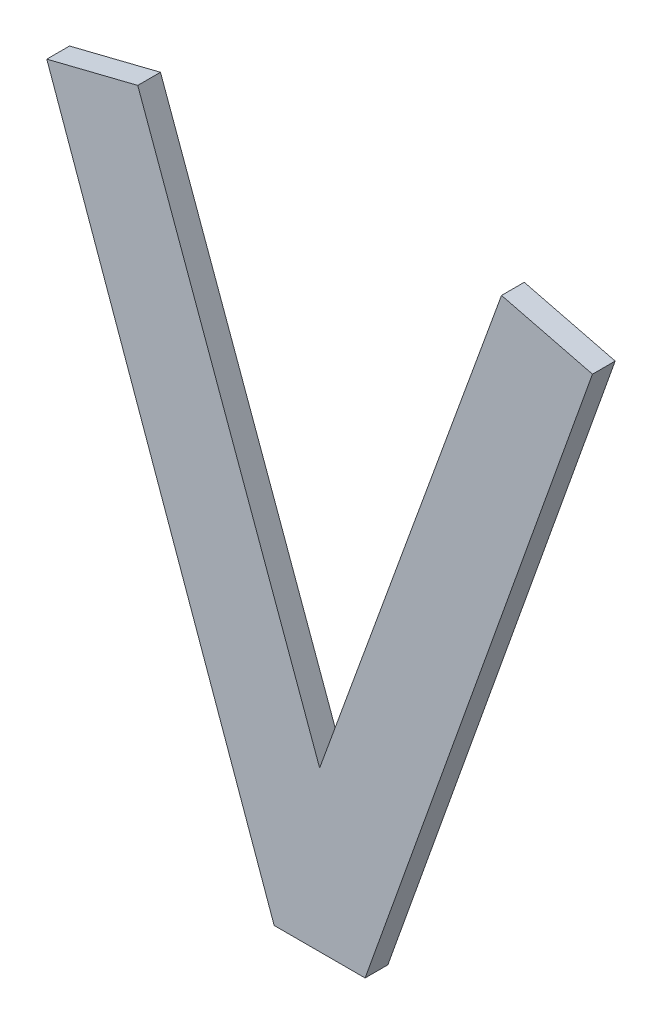
ISO-10303-21;
HEADER;
FILE_DESCRIPTION(('STEP AP214'),'2;1');
FILE_NAME('part.step','',(''),(''),'','','');
FILE_SCHEMA(('AUTOMOTIVE_DESIGN { 1 0 10303 214 1 1 1 1 }'));
ENDSEC;
DATA;
#1=APPLICATION_CONTEXT('core data for automotive mechanical design processes');
#2=APPLICATION_PROTOCOL_DEFINITION('international standard','automotive_design',2000,#1);
#3=PRODUCT_CONTEXT('',#1,'mechanical');
#4=PRODUCT('Part','Part','',(#3));
#5=PRODUCT_RELATED_PRODUCT_CATEGORY('part','',(#4));
#6=PRODUCT_DEFINITION_FORMATION('','',#4);
#7=PRODUCT_DEFINITION_CONTEXT('part definition',#1,'design');
#8=PRODUCT_DEFINITION('design','',#6,#7);
#9=PRODUCT_DEFINITION_SHAPE('','',#8);
#10=(LENGTH_UNIT() NAMED_UNIT(*) SI_UNIT(.MILLI.,.METRE.));
#11=(NAMED_UNIT(*) PLANE_ANGLE_UNIT() SI_UNIT($,.RADIAN.));
#12=(NAMED_UNIT(*) SI_UNIT($,.STERADIAN.) SOLID_ANGLE_UNIT());
#13=UNCERTAINTY_MEASURE_WITH_UNIT(LENGTH_MEASURE(1.E-05),#10,'distance_accuracy_value','');
#14=(GEOMETRIC_REPRESENTATION_CONTEXT(3) GLOBAL_UNCERTAINTY_ASSIGNED_CONTEXT((#13)) GLOBAL_UNIT_ASSIGNED_CONTEXT((#10,
#11,#12)) REPRESENTATION_CONTEXT('',''));
#15=CARTESIAN_POINT('',(0.,0.,0.));
#16=DIRECTION('',(0.,0.,1.));
#17=DIRECTION('',(1.,0.,0.));
#18=AXIS2_PLACEMENT_3D('',#15,#16,#17);
#19=CARTESIAN_POINT('',(-0.07999984,0.14500098,0.01));
#20=DIRECTION('',(0.,0.,-1.));
#21=DIRECTION('',(-1.,0.,0.));
#22=AXIS2_PLACEMENT_3D('',#19,#20,#21);
#23=PLANE('',#22);
#24=DIRECTION('',(0.336336396997966,-0.941741911594905,0.));
#25=VECTOR('',#24,1.);
#26=CARTESIAN_POINT('',(-0.01999996000001,-0.14499844,0.01));
#27=LINE('',#26,#25);
#28=CARTESIAN_POINT('',(-0.01999996000001,-0.14499844,0.01));
#29=VERTEX_POINT('',#28);
#30=CARTESIAN_POINT('',(-0.119999759999976,0.135001000000009,0.01));
#31=VERTEX_POINT('',#30);
#32=EDGE_CURVE('E111',#29,#31,#27,.F.);
#33=ORIENTED_EDGE('',*,*,#32,.F.);
#34=DIRECTION('',(1.,0.,0.));
#35=VECTOR('',#34,1.);
#36=CARTESIAN_POINT('',(0.01999995999999,-0.14499844,0.01));
#37=LINE('',#36,#35);
#38=CARTESIAN_POINT('',(0.0199999600000227,-0.144998440000012,0.01));
#39=VERTEX_POINT('',#38);
#40=EDGE_CURVE('E106',#39,#29,#37,.F.);
#41=ORIENTED_EDGE('',*,*,#40,.F.);
#42=DIRECTION('',(0.336336396997966,0.941741911594905,0.));
#43=VECTOR('',#42,1.);
#44=CARTESIAN_POINT('',(0.11999976,0.135001,0.01));
#45=LINE('',#44,#43);
#46=CARTESIAN_POINT('',(0.119999760000001,0.135001000000005,0.01));
#47=VERTEX_POINT('',#46);
#48=EDGE_CURVE('E101',#47,#39,#45,.F.);
#49=ORIENTED_EDGE('',*,*,#48,.F.);
#50=DIRECTION('',(-0.970142500145391,0.242535625036098,0.));
#51=VECTOR('',#50,1.);
#52=CARTESIAN_POINT('',(0.07999984,0.14500098,0.01));
#53=LINE('',#52,#51);
#54=CARTESIAN_POINT('',(0.079999840000047,0.145000979999983,0.01));
#55=VERTEX_POINT('',#54);
#56=EDGE_CURVE('E87',#55,#47,#53,.F.);
#57=ORIENTED_EDGE('',*,*,#56,.F.);
#58=DIRECTION('',(-0.341743063087106,-0.939793423488291,0.));
#59=VECTOR('',#58,1.);
#60=CARTESIAN_POINT('',(0.,-0.07499858,0.01));
#61=LINE('',#60,#59);
#62=CARTESIAN_POINT('',(0.,-0.0749985799999829,0.01));
#63=VERTEX_POINT('',#62);
#64=EDGE_CURVE('E72',#63,#55,#61,.F.);
#65=ORIENTED_EDGE('',*,*,#64,.F.);
#66=DIRECTION('',(-0.341743063087106,0.939793423488291,0.));
#67=VECTOR('',#66,1.);
#68=CARTESIAN_POINT('',(-0.07999984,0.14500098,0.01));
#69=LINE('',#68,#67);
#70=CARTESIAN_POINT('',(-0.0799998399999994,0.145000979999998,0.01));
#71=VERTEX_POINT('',#70);
#72=EDGE_CURVE('E19',#71,#63,#69,.F.);
#73=ORIENTED_EDGE('',*,*,#72,.F.);
#74=DIRECTION('',(-0.970142500145391,-0.242535625036098,0.));
#75=VECTOR('',#74,1.);
#76=CARTESIAN_POINT('',(-0.11999976,0.135001,0.01));
#77=LINE('',#76,#75);
#78=EDGE_CURVE('E114',#31,#71,#77,.F.);
#79=ORIENTED_EDGE('',*,*,#78,.F.);
#80=EDGE_LOOP('',(#33,#41,#49,#57,#65,#73,#79));
#81=FACE_BOUND('',#80,.T.);
#82=ADVANCED_FACE('F16',(#81),#23,.F.);
#83=CARTESIAN_POINT('',(-0.07999984,0.14500098,0.));
#84=DIRECTION('',(0.939793423488291,0.341743063087106,0.));
#85=DIRECTION('',(-0.341743063087106,0.939793423488291,0.));
#86=AXIS2_PLACEMENT_3D('',#83,#84,#85);
#87=PLANE('',#86);
#88=DIRECTION('',(0.,0.,1.));
#89=VECTOR('',#88,1.);
#90=CARTESIAN_POINT('',(0.,-0.07499858,0.));
#91=LINE('',#90,#89);
#92=CARTESIAN_POINT('',(0.,-0.0749985799999829,0.));
#93=VERTEX_POINT('',#92);
#94=EDGE_CURVE('E78',#93,#63,#91,.T.);
#95=ORIENTED_EDGE('',*,*,#94,.F.);
#96=DIRECTION('',(0.341743063086704,-0.939793423488437,0.));
#97=VECTOR('',#96,1.);
#98=CARTESIAN_POINT('',(-0.07999984,0.14500098,0.));
#99=LINE('',#98,#97);
#100=CARTESIAN_POINT('',(-0.0799998399999994,0.145000979999998,0.));
#101=VERTEX_POINT('',#100);
#102=EDGE_CURVE('E117',#101,#93,#99,.T.);
#103=ORIENTED_EDGE('',*,*,#102,.F.);
#104=DIRECTION('',(0.,0.,1.));
#105=VECTOR('',#104,1.);
#106=CARTESIAN_POINT('',(-0.0799998399999976,0.14500097999999,0.));
#107=LINE('',#106,#105);
#108=EDGE_CURVE('E81',#71,#101,#107,.F.);
#109=ORIENTED_EDGE('',*,*,#108,.F.);
#110=ORIENTED_EDGE('',*,*,#72,.T.);
#111=EDGE_LOOP('',(#95,#103,#109,#110));
#112=FACE_BOUND('',#111,.T.);
#113=ADVANCED_FACE('F77',(#112),#87,.T.);
#114=CARTESIAN_POINT('',(0.,-0.07499858,0.));
#115=DIRECTION('',(-0.939793423488291,0.341743063087106,0.));
#116=DIRECTION('',(-0.341743063087106,-0.939793423488291,0.));
#117=AXIS2_PLACEMENT_3D('',#114,#115,#116);
#118=PLANE('',#117);
#119=DIRECTION('',(0.,0.,1.));
#120=VECTOR('',#119,1.);
#121=CARTESIAN_POINT('',(0.07999984,0.14500098,0.));
#122=LINE('',#121,#120);
#123=CARTESIAN_POINT('',(0.079999840000047,0.145000979999983,0.));
#124=VERTEX_POINT('',#123);
#125=EDGE_CURVE('E89',#124,#55,#122,.T.);
#126=ORIENTED_EDGE('',*,*,#125,.F.);
#127=DIRECTION('',(0.341743063086704,0.939793423488437,0.));
#128=VECTOR('',#127,1.);
#129=CARTESIAN_POINT('',(0.,-0.07499858,0.));
#130=LINE('',#129,#128);
#131=EDGE_CURVE('E93',#93,#124,#130,.T.);
#132=ORIENTED_EDGE('',*,*,#131,.F.);
#133=ORIENTED_EDGE('',*,*,#94,.T.);
#134=ORIENTED_EDGE('',*,*,#64,.T.);
#135=EDGE_LOOP('',(#126,#132,#133,#134));
#136=FACE_BOUND('',#135,.T.);
#137=ADVANCED_FACE('F91',(#136),#118,.T.);
#138=CARTESIAN_POINT('',(0.07999984,0.14500098,0.));
#139=DIRECTION('',(0.242535625036098,0.970142500145391,0.));
#140=DIRECTION('',(-0.970142500145391,0.242535625036098,0.));
#141=AXIS2_PLACEMENT_3D('',#138,#139,#140);
#142=PLANE('',#141);
#143=DIRECTION('',(0.,0.,1.));
#144=VECTOR('',#143,1.);
#145=CARTESIAN_POINT('',(0.11999976,0.135001,0.));
#146=LINE('',#145,#144);
#147=CARTESIAN_POINT('',(0.119999760000001,0.135001000000005,0.));
#148=VERTEX_POINT('',#147);
#149=EDGE_CURVE('E98',#148,#47,#146,.T.);
#150=ORIENTED_EDGE('',*,*,#149,.F.);
#151=DIRECTION('',(0.970142500145332,-0.242535625036333,0.));
#152=VECTOR('',#151,1.);
#153=CARTESIAN_POINT('',(0.07999984,0.14500098,0.));
#154=LINE('',#153,#152);
#155=EDGE_CURVE('E120',#124,#148,#154,.T.);
#156=ORIENTED_EDGE('',*,*,#155,.F.);
#157=ORIENTED_EDGE('',*,*,#125,.T.);
#158=ORIENTED_EDGE('',*,*,#56,.T.);
#159=EDGE_LOOP('',(#150,#156,#157,#158));
#160=FACE_BOUND('',#159,.T.);
#161=ADVANCED_FACE('F154',(#160),#142,.T.);
#162=CARTESIAN_POINT('',(0.11999976,0.135001,0.));
#163=DIRECTION('',(0.941741911594905,-0.336336396997966,0.));
#164=DIRECTION('',(0.336336396997966,0.941741911594905,0.));
#165=AXIS2_PLACEMENT_3D('',#162,#163,#164);
#166=PLANE('',#165);
#167=DIRECTION('',(0.,0.,-1.));
#168=VECTOR('',#167,1.);
#169=CARTESIAN_POINT('',(0.01999995999999,-0.14499844,0.));
#170=LINE('',#169,#168);
#171=CARTESIAN_POINT('',(0.0199999600000227,-0.144998440000012,0.));
#172=VERTEX_POINT('',#171);
#173=EDGE_CURVE('E103',#172,#39,#170,.F.);
#174=ORIENTED_EDGE('',*,*,#173,.F.);
#175=DIRECTION('',(-0.336336396998186,-0.941741911594827,0.));
#176=VECTOR('',#175,1.);
#177=CARTESIAN_POINT('',(0.11999976,0.135001,0.));
#178=LINE('',#177,#176);
#179=EDGE_CURVE('E123',#148,#172,#178,.T.);
#180=ORIENTED_EDGE('',*,*,#179,.F.);
#181=ORIENTED_EDGE('',*,*,#149,.T.);
#182=ORIENTED_EDGE('',*,*,#48,.T.);
#183=EDGE_LOOP('',(#174,#180,#181,#182));
#184=FACE_BOUND('',#183,.T.);
#185=ADVANCED_FACE('F151',(#184),#166,.T.);
#186=CARTESIAN_POINT('',(0.01999995999999,-0.14499844,0.));
#187=DIRECTION('',(0.,-1.,0.));
#188=DIRECTION('',(0.,0.,-1.));
#189=AXIS2_PLACEMENT_3D('',#186,#187,#188);
#190=PLANE('',#189);
#191=DIRECTION('',(0.,0.,1.));
#192=VECTOR('',#191,1.);
#193=CARTESIAN_POINT('',(-0.01999996000001,-0.14499844,0.));
#194=LINE('',#193,#192);
#195=CARTESIAN_POINT('',(-0.01999996000001,-0.14499844,0.));
#196=VERTEX_POINT('',#195);
#197=EDGE_CURVE('E108',#196,#29,#194,.T.);
#198=ORIENTED_EDGE('',*,*,#197,.F.);
#199=DIRECTION('',(-1.,0.,0.));
#200=VECTOR('',#199,1.);
#201=CARTESIAN_POINT('',(-0.07999984,-0.14499844,0.));
#202=LINE('',#201,#200);
#203=EDGE_CURVE('E126',#172,#196,#202,.T.);
#204=ORIENTED_EDGE('',*,*,#203,.F.);
#205=ORIENTED_EDGE('',*,*,#173,.T.);
#206=ORIENTED_EDGE('',*,*,#40,.T.);
#207=EDGE_LOOP('',(#198,#204,#205,#206));
#208=FACE_BOUND('',#207,.T.);
#209=ADVANCED_FACE('F135',(#208),#190,.T.);
#210=CARTESIAN_POINT('',(-0.01999996000001,-0.14499844,0.));
#211=DIRECTION('',(-0.941741911594905,-0.336336396997966,0.));
#212=DIRECTION('',(0.336336396997966,-0.941741911594905,0.));
#213=AXIS2_PLACEMENT_3D('',#210,#211,#212);
#214=PLANE('',#213);
#215=DIRECTION('',(0.,0.,1.));
#216=VECTOR('',#215,1.);
#217=CARTESIAN_POINT('',(-0.11999976,0.135001,0.));
#218=LINE('',#217,#216);
#219=CARTESIAN_POINT('',(-0.119999759999976,0.135001000000009,0.));
#220=VERTEX_POINT('',#219);
#221=EDGE_CURVE('E34',#220,#31,#218,.T.);
#222=ORIENTED_EDGE('',*,*,#221,.F.);
#223=DIRECTION('',(-0.336336396998126,0.941741911594848,0.));
#224=VECTOR('',#223,1.);
#225=CARTESIAN_POINT('',(-0.01999996000001,-0.14499844,0.));
#226=LINE('',#225,#224);
#227=EDGE_CURVE('E25',#196,#220,#226,.T.);
#228=ORIENTED_EDGE('',*,*,#227,.F.);
#229=ORIENTED_EDGE('',*,*,#197,.T.);
#230=ORIENTED_EDGE('',*,*,#32,.T.);
#231=EDGE_LOOP('',(#222,#228,#229,#230));
#232=FACE_BOUND('',#231,.T.);
#233=ADVANCED_FACE('F133',(#232),#214,.T.);
#234=CARTESIAN_POINT('',(-0.11999976,0.135001,0.));
#235=DIRECTION('',(-0.242535625036098,0.970142500145391,0.));
#236=DIRECTION('',(-0.970142500145391,-0.242535625036098,0.));
#237=AXIS2_PLACEMENT_3D('',#234,#235,#236);
#238=PLANE('',#237);
#239=ORIENTED_EDGE('',*,*,#108,.T.);
#240=DIRECTION('',(0.970142500145332,0.242535625036333,0.));
#241=VECTOR('',#240,1.);
#242=CARTESIAN_POINT('',(-0.11999976,0.135001,0.));
#243=LINE('',#242,#241);
#244=EDGE_CURVE('E11',#220,#101,#243,.T.);
#245=ORIENTED_EDGE('',*,*,#244,.F.);
#246=ORIENTED_EDGE('',*,*,#221,.T.);
#247=ORIENTED_EDGE('',*,*,#78,.T.);
#248=EDGE_LOOP('',(#239,#245,#246,#247));
#249=FACE_BOUND('',#248,.T.);
#250=ADVANCED_FACE('F138',(#249),#238,.T.);
#251=CARTESIAN_POINT('',(-0.07999984,0.14500098,0.));
#252=DIRECTION('',(0.,0.,-1.));
#253=DIRECTION('',(-1.,0.,0.));
#254=AXIS2_PLACEMENT_3D('',#251,#252,#253);
#255=PLANE('',#254);
#256=ORIENTED_EDGE('',*,*,#227,.T.);
#257=ORIENTED_EDGE('',*,*,#244,.T.);
#258=ORIENTED_EDGE('',*,*,#102,.T.);
#259=ORIENTED_EDGE('',*,*,#131,.T.);
#260=ORIENTED_EDGE('',*,*,#155,.T.);
#261=ORIENTED_EDGE('',*,*,#179,.T.);
#262=ORIENTED_EDGE('',*,*,#203,.T.);
#263=EDGE_LOOP('',(#256,#257,#258,#259,#260,#261,#262));
#264=FACE_BOUND('',#263,.T.);
#265=ADVANCED_FACE('F131',(#264),#255,.T.);
#266=CLOSED_SHELL('',(#82,#113,#137,#161,#185,#209,#233,#250,#265));
#267=MANIFOLD_SOLID_BREP('B1',#266);
#268=ADVANCED_BREP_SHAPE_REPRESENTATION('',(#18,#267),#14);
#269=SHAPE_DEFINITION_REPRESENTATION(#9,#268);
ENDSEC;
END-ISO-10303-21;
